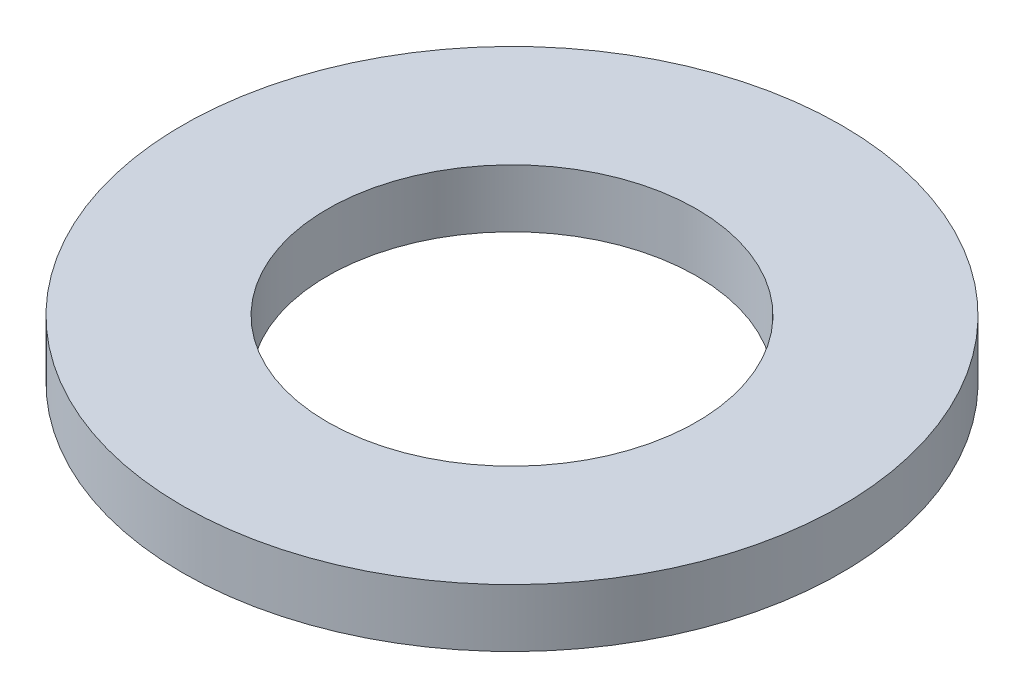
ISO-10303-21;
HEADER;
FILE_DESCRIPTION(('STEP AP214'),'2;1');
FILE_NAME('part.step','',(''),(''),'','','');
FILE_SCHEMA(('AUTOMOTIVE_DESIGN { 1 0 10303 214 1 1 1 1 }'));
ENDSEC;
DATA;
#1=APPLICATION_CONTEXT('core data for automotive mechanical design processes');
#2=APPLICATION_PROTOCOL_DEFINITION('international standard','automotive_design',2000,#1);
#3=PRODUCT_CONTEXT('',#1,'mechanical');
#4=PRODUCT('Part','Part','',(#3));
#5=PRODUCT_RELATED_PRODUCT_CATEGORY('part','',(#4));
#6=PRODUCT_DEFINITION_FORMATION('','',#4);
#7=PRODUCT_DEFINITION_CONTEXT('part definition',#1,'design');
#8=PRODUCT_DEFINITION('design','',#6,#7);
#9=PRODUCT_DEFINITION_SHAPE('','',#8);
#10=(LENGTH_UNIT() NAMED_UNIT(*) SI_UNIT(.MILLI.,.METRE.));
#11=(NAMED_UNIT(*) PLANE_ANGLE_UNIT() SI_UNIT($,.RADIAN.));
#12=(NAMED_UNIT(*) SI_UNIT($,.STERADIAN.) SOLID_ANGLE_UNIT());
#13=UNCERTAINTY_MEASURE_WITH_UNIT(LENGTH_MEASURE(1.E-05),#10,'distance_accuracy_value','');
#14=(GEOMETRIC_REPRESENTATION_CONTEXT(3) GLOBAL_UNCERTAINTY_ASSIGNED_CONTEXT((#13)) GLOBAL_UNIT_ASSIGNED_CONTEXT((#10,
#11,#12)) REPRESENTATION_CONTEXT('',''));
#15=CARTESIAN_POINT('',(0.,0.,0.));
#16=DIRECTION('',(0.,0.,1.));
#17=DIRECTION('',(1.,0.,0.));
#18=AXIS2_PLACEMENT_3D('',#15,#16,#17);
#19=CARTESIAN_POINT('',(0.,11.,0.));
#20=DIRECTION('',(0.,-1.,0.));
#21=DIRECTION('',(0.,0.,-1.));
#22=AXIS2_PLACEMENT_3D('',#19,#20,#21);
#23=CYLINDRICAL_SURFACE('',#22,62.5);
#24=CARTESIAN_POINT('',(0.,11.,0.));
#25=DIRECTION('',(0.,1.,0.));
#26=DIRECTION('',(0.,0.,1.));
#27=AXIS2_PLACEMENT_3D('',#24,#25,#26);
#28=CIRCLE('',#27,62.5);
#29=CARTESIAN_POINT('',(0.,11.,62.5));
#30=VERTEX_POINT('',#29);
#31=EDGE_CURVE('E10',#30,#30,#28,.T.);
#32=ORIENTED_EDGE('',*,*,#31,.F.);
#33=EDGE_LOOP('',(#32));
#34=FACE_BOUND('',#33,.T.);
#35=CARTESIAN_POINT('',(0.,0.,0.));
#36=DIRECTION('',(0.,1.,0.));
#37=DIRECTION('',(0.,0.,1.));
#38=AXIS2_PLACEMENT_3D('',#35,#36,#37);
#39=CIRCLE('',#38,62.5);
#40=CARTESIAN_POINT('',(0.,0.,62.5));
#41=VERTEX_POINT('',#40);
#42=EDGE_CURVE('E37',#41,#41,#39,.T.);
#43=ORIENTED_EDGE('',*,*,#42,.T.);
#44=EDGE_LOOP('',(#43));
#45=FACE_BOUND('',#44,.T.);
#46=ADVANCED_FACE('F40',(#34,#45),#23,.T.);
#47=CARTESIAN_POINT('',(0.,11.,0.));
#48=DIRECTION('',(0.,1.,0.));
#49=DIRECTION('',(0.,0.,1.));
#50=AXIS2_PLACEMENT_3D('',#47,#48,#49);
#51=PLANE('',#50);
#52=CARTESIAN_POINT('',(0.,11.,0.));
#53=DIRECTION('',(0.,1.,0.));
#54=DIRECTION('',(0.,0.,1.));
#55=AXIS2_PLACEMENT_3D('',#52,#53,#54);
#56=CIRCLE('',#55,35.);
#57=CARTESIAN_POINT('',(0.,11.,35.));
#58=VERTEX_POINT('',#57);
#59=EDGE_CURVE('E50',#58,#58,#56,.T.);
#60=ORIENTED_EDGE('',*,*,#59,.F.);
#61=EDGE_LOOP('',(#60));
#62=FACE_BOUND('',#61,.T.);
#63=ORIENTED_EDGE('',*,*,#31,.T.);
#64=EDGE_LOOP('',(#63));
#65=FACE_BOUND('',#64,.T.);
#66=ADVANCED_FACE('F59',(#62,#65),#51,.T.);
#67=CARTESIAN_POINT('',(0.,0.,0.));
#68=DIRECTION('',(0.,1.,0.));
#69=DIRECTION('',(0.,0.,1.));
#70=AXIS2_PLACEMENT_3D('',#67,#68,#69);
#71=PLANE('',#70);
#72=CARTESIAN_POINT('',(0.,0.,0.));
#73=DIRECTION('',(0.,1.,0.));
#74=DIRECTION('',(0.,0.,1.));
#75=AXIS2_PLACEMENT_3D('',#72,#73,#74);
#76=CIRCLE('',#75,35.);
#77=CARTESIAN_POINT('',(0.,0.,35.));
#78=VERTEX_POINT('',#77);
#79=EDGE_CURVE('E47',#78,#78,#76,.T.);
#80=ORIENTED_EDGE('',*,*,#79,.T.);
#81=EDGE_LOOP('',(#80));
#82=FACE_BOUND('',#81,.T.);
#83=ORIENTED_EDGE('',*,*,#42,.F.);
#84=EDGE_LOOP('',(#83));
#85=FACE_BOUND('',#84,.T.);
#86=ADVANCED_FACE('F58',(#82,#85),#71,.F.);
#87=CARTESIAN_POINT('',(0.,11.,0.));
#88=DIRECTION('',(0.,-1.,0.));
#89=DIRECTION('',(0.,0.,-1.));
#90=AXIS2_PLACEMENT_3D('',#87,#88,#89);
#91=CYLINDRICAL_SURFACE('',#90,35.);
#92=ORIENTED_EDGE('',*,*,#59,.T.);
#93=EDGE_LOOP('',(#92));
#94=FACE_BOUND('',#93,.T.);
#95=ORIENTED_EDGE('',*,*,#79,.F.);
#96=EDGE_LOOP('',(#95));
#97=FACE_BOUND('',#96,.T.);
#98=ADVANCED_FACE('F54',(#94,#97),#91,.F.);
#99=CLOSED_SHELL('',(#46,#66,#86,#98));
#100=MANIFOLD_SOLID_BREP('B2',#99);
#101=ADVANCED_BREP_SHAPE_REPRESENTATION('',(#18,#100),#14);
#102=SHAPE_DEFINITION_REPRESENTATION(#9,#101);
ENDSEC;
END-ISO-10303-21;
